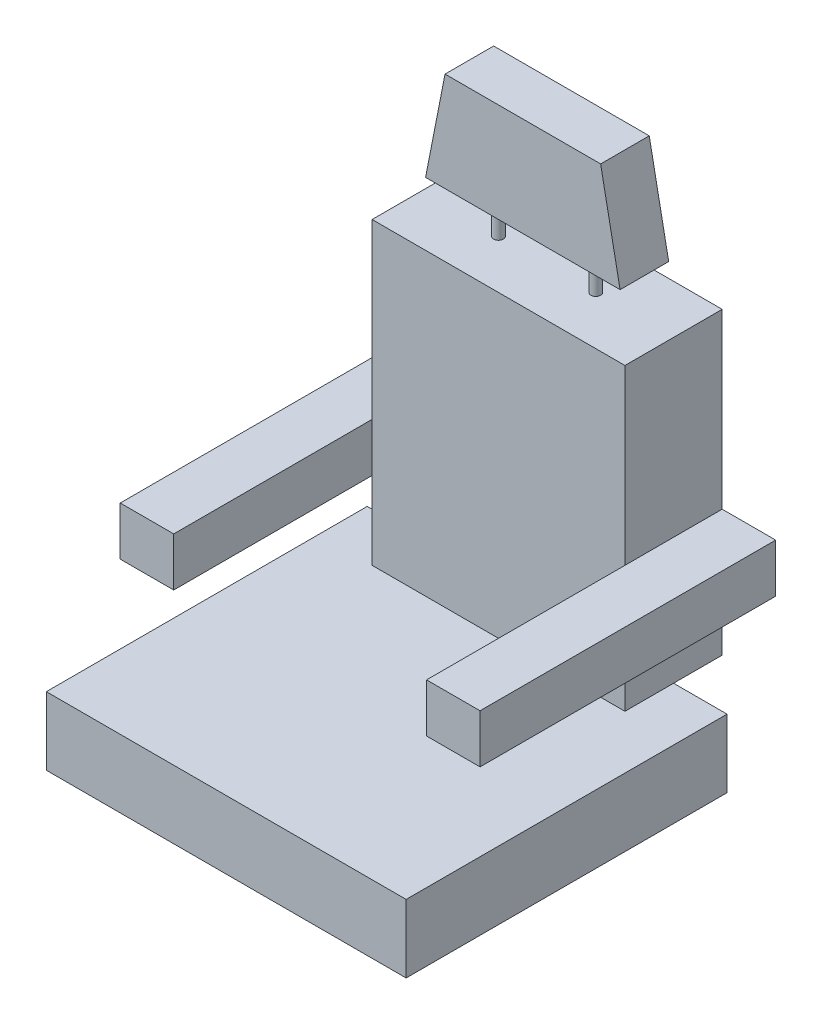
ISO-10303-21;
HEADER;
FILE_DESCRIPTION(('STEP AP214'),'2;1');
FILE_NAME('part.step','',(''),(''),'','','');
FILE_SCHEMA(('AUTOMOTIVE_DESIGN { 1 0 10303 214 1 1 1 1 }'));
ENDSEC;
DATA;
#1=APPLICATION_CONTEXT('core data for automotive mechanical design processes');
#2=APPLICATION_PROTOCOL_DEFINITION('international standard','automotive_design',2000,#1);
#3=PRODUCT_CONTEXT('',#1,'mechanical');
#4=PRODUCT('Part','Part','',(#3));
#5=PRODUCT_RELATED_PRODUCT_CATEGORY('part','',(#4));
#6=PRODUCT_DEFINITION_FORMATION('','',#4);
#7=PRODUCT_DEFINITION_CONTEXT('part definition',#1,'design');
#8=PRODUCT_DEFINITION('design','',#6,#7);
#9=PRODUCT_DEFINITION_SHAPE('','',#8);
#10=(LENGTH_UNIT() NAMED_UNIT(*) SI_UNIT(.MILLI.,.METRE.));
#11=(NAMED_UNIT(*) PLANE_ANGLE_UNIT() SI_UNIT($,.RADIAN.));
#12=(NAMED_UNIT(*) SI_UNIT($,.STERADIAN.) SOLID_ANGLE_UNIT());
#13=UNCERTAINTY_MEASURE_WITH_UNIT(LENGTH_MEASURE(1.E-05),#10,'distance_accuracy_value','');
#14=(GEOMETRIC_REPRESENTATION_CONTEXT(3) GLOBAL_UNCERTAINTY_ASSIGNED_CONTEXT((#13)) GLOBAL_UNIT_ASSIGNED_CONTEXT((#10,
#11,#12)) REPRESENTATION_CONTEXT('',''));
#15=CARTESIAN_POINT('',(0.,0.,0.));
#16=DIRECTION('',(0.,0.,1.));
#17=DIRECTION('',(1.,0.,0.));
#18=AXIS2_PLACEMENT_3D('',#15,#16,#17);
#19=CARTESIAN_POINT('',(-127.,660.4,-241.3));
#20=DIRECTION('',(0.,0.,1.));
#21=DIRECTION('',(1.,0.,0.));
#22=AXIS2_PLACEMENT_3D('',#19,#20,#21);
#23=PLANE('',#22);
#24=DIRECTION('',(-0.192414460721011,0.981313749677157,0.));
#25=VECTOR('',#24,1.);
#26=CARTESIAN_POINT('',(93.1364679748241,703.564013328397,-241.3));
#27=LINE('',#26,#25);
#28=CARTESIAN_POINT('',(127.,530.86,-241.3));
#29=VERTEX_POINT('',#28);
#30=CARTESIAN_POINT('',(101.6,660.4,-241.3));
#31=VERTEX_POINT('',#30);
#32=EDGE_CURVE('E184',#29,#31,#27,.T.);
#33=ORIENTED_EDGE('',*,*,#32,.F.);
#34=DIRECTION('',(-1.,0.,0.));
#35=VECTOR('',#34,1.);
#36=CARTESIAN_POINT('',(-127.,530.86,-241.3));
#37=LINE('',#36,#35);
#38=CARTESIAN_POINT('',(-127.,530.86,-241.3));
#39=VERTEX_POINT('',#38);
#40=EDGE_CURVE('E214',#29,#39,#37,.T.);
#41=ORIENTED_EDGE('',*,*,#40,.T.);
#42=DIRECTION('',(0.192414460721011,0.981313749677157,0.));
#43=VECTOR('',#42,1.);
#44=CARTESIAN_POINT('',(-102.540392447242,655.603998519067,-241.3));
#45=LINE('',#44,#43);
#46=CARTESIAN_POINT('',(-101.6,660.4,-241.3));
#47=VERTEX_POINT('',#46);
#48=EDGE_CURVE('E189',#39,#47,#45,.T.);
#49=ORIENTED_EDGE('',*,*,#48,.T.);
#50=DIRECTION('',(-1.,0.,0.));
#51=VECTOR('',#50,1.);
#52=CARTESIAN_POINT('',(-127.,660.4,-241.3));
#53=LINE('',#52,#51);
#54=EDGE_CURVE('E204',#31,#47,#53,.T.);
#55=ORIENTED_EDGE('',*,*,#54,.F.);
#56=EDGE_LOOP('',(#33,#41,#49,#55));
#57=FACE_BOUND('',#56,.T.);
#58=ADVANCED_FACE('F53',(#57),#23,.F.);
#59=CARTESIAN_POINT('',(-127.,660.4,-177.8));
#60=DIRECTION('',(0.,0.,-1.));
#61=DIRECTION('',(-1.,0.,0.));
#62=AXIS2_PLACEMENT_3D('',#59,#60,#61);
#63=PLANE('',#62);
#64=DIRECTION('',(-0.192414460721011,0.981313749677157,0.));
#65=VECTOR('',#64,1.);
#66=CARTESIAN_POINT('',(222.534468715291,43.6342095520177,-177.8));
#67=LINE('',#66,#65);
#68=CARTESIAN_POINT('',(127.,530.86,-177.8));
#69=VERTEX_POINT('',#68);
#70=CARTESIAN_POINT('',(101.6,660.4,-177.8));
#71=VERTEX_POINT('',#70);
#72=EDGE_CURVE('E181',#69,#71,#67,.T.);
#73=ORIENTED_EDGE('',*,*,#72,.T.);
#74=DIRECTION('',(1.,0.,0.));
#75=VECTOR('',#74,1.);
#76=CARTESIAN_POINT('',(-127.,660.4,-177.8));
#77=LINE('',#76,#75);
#78=CARTESIAN_POINT('',(-101.6,660.4,-177.8));
#79=VERTEX_POINT('',#78);
#80=EDGE_CURVE('E195',#79,#71,#77,.T.);
#81=ORIENTED_EDGE('',*,*,#80,.F.);
#82=DIRECTION('',(0.192414460721011,0.981313749677157,0.));
#83=VECTOR('',#82,1.);
#84=CARTESIAN_POINT('',(-222.534468715291,43.6342095520177,-177.8));
#85=LINE('',#84,#83);
#86=CARTESIAN_POINT('',(-127.,530.86,-177.8));
#87=VERTEX_POINT('',#86);
#88=EDGE_CURVE('E486',#87,#79,#85,.T.);
#89=ORIENTED_EDGE('',*,*,#88,.F.);
#90=DIRECTION('',(1.,0.,0.));
#91=VECTOR('',#90,1.);
#92=CARTESIAN_POINT('',(-127.,530.86,-177.8));
#93=LINE('',#92,#91);
#94=EDGE_CURVE('E197',#87,#69,#93,.T.);
#95=ORIENTED_EDGE('',*,*,#94,.T.);
#96=EDGE_LOOP('',(#73,#81,#89,#95));
#97=FACE_BOUND('',#96,.T.);
#98=ADVANCED_FACE('F193',(#97),#63,.F.);
#99=CARTESIAN_POINT('',(0.,660.4,0.));
#100=DIRECTION('',(0.,-1.,0.));
#101=DIRECTION('',(0.,0.,-1.));
#102=AXIS2_PLACEMENT_3D('',#99,#100,#101);
#103=PLANE('',#102);
#104=DIRECTION('',(0.,0.,1.));
#105=VECTOR('',#104,1.);
#106=CARTESIAN_POINT('',(101.6,660.4,-307.34));
#107=LINE('',#106,#105);
#108=EDGE_CURVE('E178',#31,#71,#107,.T.);
#109=ORIENTED_EDGE('',*,*,#108,.F.);
#110=ORIENTED_EDGE('',*,*,#54,.T.);
#111=DIRECTION('',(0.,0.,1.));
#112=VECTOR('',#111,1.);
#113=CARTESIAN_POINT('',(-101.6,660.4,-307.34));
#114=LINE('',#113,#112);
#115=EDGE_CURVE('E199',#47,#79,#114,.T.);
#116=ORIENTED_EDGE('',*,*,#115,.T.);
#117=ORIENTED_EDGE('',*,*,#80,.T.);
#118=EDGE_LOOP('',(#109,#110,#116,#117));
#119=FACE_BOUND('',#118,.T.);
#120=ADVANCED_FACE('F202',(#119),#103,.F.);
#121=CARTESIAN_POINT('',(-165.1,88.9,-146.05));
#122=DIRECTION('',(1.,0.,0.));
#123=DIRECTION('',(0.,0.,-1.));
#124=AXIS2_PLACEMENT_3D('',#121,#122,#123);
#125=PLANE('',#124);
#126=DIRECTION('',(0.,-1.,0.));
#127=VECTOR('',#126,1.);
#128=CARTESIAN_POINT('',(-165.1,88.9,-273.05));
#129=LINE('',#128,#127);
#130=CARTESIAN_POINT('',(-165.1,480.06,-273.05));
#131=VERTEX_POINT('',#130);
#132=CARTESIAN_POINT('',(-165.1,254.,-273.05));
#133=VERTEX_POINT('',#132);
#134=EDGE_CURVE('E297',#131,#133,#129,.T.);
#135=ORIENTED_EDGE('',*,*,#134,.T.);
#136=DIRECTION('',(0.,0.,1.));
#137=VECTOR('',#136,1.);
#138=CARTESIAN_POINT('',(-165.1,254.,-273.05));
#139=LINE('',#138,#137);
#140=CARTESIAN_POINT('',(-165.1,254.,-146.05));
#141=VERTEX_POINT('',#140);
#142=EDGE_CURVE('E227',#133,#141,#139,.T.);
#143=ORIENTED_EDGE('',*,*,#142,.T.);
#144=DIRECTION('',(0.,-1.,0.));
#145=VECTOR('',#144,1.);
#146=CARTESIAN_POINT('',(-165.1,88.9,-146.05));
#147=LINE('',#146,#145);
#148=CARTESIAN_POINT('',(-165.1,480.06,-146.05));
#149=VERTEX_POINT('',#148);
#150=EDGE_CURVE('E283',#149,#141,#147,.T.);
#151=ORIENTED_EDGE('',*,*,#150,.F.);
#152=DIRECTION('',(0.,0.,-1.));
#153=VECTOR('',#152,1.);
#154=CARTESIAN_POINT('',(-165.1,480.06,-146.05));
#155=LINE('',#154,#153);
#156=EDGE_CURVE('E296',#149,#131,#155,.T.);
#157=ORIENTED_EDGE('',*,*,#156,.T.);
#158=EDGE_LOOP('',(#135,#143,#151,#157));
#159=FACE_BOUND('',#158,.T.);
#160=ADVANCED_FACE('F360',(#159),#125,.F.);
#161=CARTESIAN_POINT('',(165.1,88.9,-146.05));
#162=DIRECTION('',(-1.,0.,0.));
#163=DIRECTION('',(0.,0.,1.));
#164=AXIS2_PLACEMENT_3D('',#161,#162,#163);
#165=PLANE('',#164);
#166=DIRECTION('',(0.,0.,-1.));
#167=VECTOR('',#166,1.);
#168=CARTESIAN_POINT('',(165.1,190.5,-273.05));
#169=LINE('',#168,#167);
#170=CARTESIAN_POINT('',(165.1,190.5,-146.05));
#171=VERTEX_POINT('',#170);
#172=CARTESIAN_POINT('',(165.1,190.5,-273.05));
#173=VERTEX_POINT('',#172);
#174=EDGE_CURVE('E76',#171,#173,#169,.T.);
#175=ORIENTED_EDGE('',*,*,#174,.F.);
#176=DIRECTION('',(0.,1.,0.));
#177=VECTOR('',#176,1.);
#178=CARTESIAN_POINT('',(165.1,88.9,-146.05));
#179=LINE('',#178,#177);
#180=CARTESIAN_POINT('',(165.1,88.9,-146.05));
#181=VERTEX_POINT('',#180);
#182=EDGE_CURVE('E291',#181,#171,#179,.T.);
#183=ORIENTED_EDGE('',*,*,#182,.F.);
#184=DIRECTION('',(0.,0.,-1.));
#185=VECTOR('',#184,1.);
#186=CARTESIAN_POINT('',(165.1,88.9,-146.05));
#187=LINE('',#186,#185);
#188=CARTESIAN_POINT('',(165.1,88.9,-273.05));
#189=VERTEX_POINT('',#188);
#190=EDGE_CURVE('E312',#181,#189,#187,.T.);
#191=ORIENTED_EDGE('',*,*,#190,.T.);
#192=DIRECTION('',(0.,1.,0.));
#193=VECTOR('',#192,1.);
#194=CARTESIAN_POINT('',(165.1,88.9,-273.05));
#195=LINE('',#194,#193);
#196=EDGE_CURVE('E303',#189,#173,#195,.T.);
#197=ORIENTED_EDGE('',*,*,#196,.T.);
#198=EDGE_LOOP('',(#175,#183,#191,#197));
#199=FACE_BOUND('',#198,.T.);
#200=ADVANCED_FACE('F496',(#199),#165,.F.);
#201=DIRECTION('',(0.,0.,1.));
#202=VECTOR('',#201,1.);
#203=CARTESIAN_POINT('',(165.1,254.,-273.05));
#204=LINE('',#203,#202);
#205=CARTESIAN_POINT('',(165.1,254.,-273.05));
#206=VERTEX_POINT('',#205);
#207=CARTESIAN_POINT('',(165.1,254.,-146.05));
#208=VERTEX_POINT('',#207);
#209=EDGE_CURVE('E264',#206,#208,#204,.T.);
#210=ORIENTED_EDGE('',*,*,#209,.F.);
#211=CARTESIAN_POINT('',(165.1,480.06,-273.05));
#212=VERTEX_POINT('',#211);
#213=EDGE_CURVE('E302',#206,#212,#195,.T.);
#214=ORIENTED_EDGE('',*,*,#213,.T.);
#215=DIRECTION('',(0.,0.,-1.));
#216=VECTOR('',#215,1.);
#217=CARTESIAN_POINT('',(165.1,480.06,-146.05));
#218=LINE('',#217,#216);
#219=CARTESIAN_POINT('',(165.1,480.06,-146.05));
#220=VERTEX_POINT('',#219);
#221=EDGE_CURVE('E309',#220,#212,#218,.T.);
#222=ORIENTED_EDGE('',*,*,#221,.F.);
#223=EDGE_CURVE('E290',#208,#220,#179,.T.);
#224=ORIENTED_EDGE('',*,*,#223,.F.);
#225=EDGE_LOOP('',(#210,#214,#222,#224));
#226=FACE_BOUND('',#225,.T.);
#227=ADVANCED_FACE('F354',(#226),#165,.F.);
#228=CARTESIAN_POINT('',(-165.1,190.5,-146.05));
#229=VERTEX_POINT('',#228);
#230=CARTESIAN_POINT('',(-165.1,88.9,-146.05));
#231=VERTEX_POINT('',#230);
#232=EDGE_CURVE('E288',#229,#231,#147,.T.);
#233=ORIENTED_EDGE('',*,*,#232,.F.);
#234=DIRECTION('',(0.,0.,-1.));
#235=VECTOR('',#234,1.);
#236=CARTESIAN_POINT('',(-165.1,190.5,-273.05));
#237=LINE('',#236,#235);
#238=CARTESIAN_POINT('',(-165.1,190.5,-273.05));
#239=VERTEX_POINT('',#238);
#240=EDGE_CURVE('E239',#229,#239,#237,.T.);
#241=ORIENTED_EDGE('',*,*,#240,.T.);
#242=CARTESIAN_POINT('',(-165.1,88.9,-273.05));
#243=VERTEX_POINT('',#242);
#244=EDGE_CURVE('E282',#239,#243,#129,.T.);
#245=ORIENTED_EDGE('',*,*,#244,.T.);
#246=DIRECTION('',(0.,0.,-1.));
#247=VECTOR('',#246,1.);
#248=CARTESIAN_POINT('',(-165.1,88.9,-146.05));
#249=LINE('',#248,#247);
#250=EDGE_CURVE('E315',#231,#243,#249,.T.);
#251=ORIENTED_EDGE('',*,*,#250,.F.);
#252=EDGE_LOOP('',(#233,#241,#245,#251));
#253=FACE_BOUND('',#252,.T.);
#254=ADVANCED_FACE('F55',(#253),#125,.F.);
#255=CARTESIAN_POINT('',(-165.1,88.9,-146.05));
#256=DIRECTION('',(0.,1.,0.));
#257=DIRECTION('',(0.,0.,1.));
#258=AXIS2_PLACEMENT_3D('',#255,#256,#257);
#259=PLANE('',#258);
#260=DIRECTION('',(1.,0.,0.));
#261=VECTOR('',#260,1.);
#262=CARTESIAN_POINT('',(-165.1,88.9,-273.05));
#263=LINE('',#262,#261);
#264=EDGE_CURVE('E300',#243,#189,#263,.T.);
#265=ORIENTED_EDGE('',*,*,#264,.T.);
#266=ORIENTED_EDGE('',*,*,#190,.F.);
#267=DIRECTION('',(1.,0.,0.));
#268=VECTOR('',#267,1.);
#269=CARTESIAN_POINT('',(-165.1,88.9,-146.05));
#270=LINE('',#269,#268);
#271=EDGE_CURVE('E286',#231,#181,#270,.T.);
#272=ORIENTED_EDGE('',*,*,#271,.F.);
#273=ORIENTED_EDGE('',*,*,#250,.T.);
#274=EDGE_LOOP('',(#265,#266,#272,#273));
#275=FACE_BOUND('',#274,.T.);
#276=ADVANCED_FACE('F425',(#275),#259,.F.);
#277=CARTESIAN_POINT('',(-165.1,480.06,-146.05));
#278=DIRECTION('',(0.,-1.,0.));
#279=DIRECTION('',(0.,0.,-1.));
#280=AXIS2_PLACEMENT_3D('',#277,#278,#279);
#281=PLANE('',#280);
#282=CARTESIAN_POINT('',(63.5,480.06,-209.55));
#283=DIRECTION('',(0.,-1.,0.));
#284=DIRECTION('',(0.,0.,-1.));
#285=AXIS2_PLACEMENT_3D('',#282,#283,#284);
#286=CIRCLE('',#285,6.34999999999999);
#287=CARTESIAN_POINT('',(63.5,480.06,-215.9));
#288=VERTEX_POINT('',#287);
#289=EDGE_CURVE('E12',#288,#288,#286,.F.);
#290=ORIENTED_EDGE('',*,*,#289,.F.);
#291=EDGE_LOOP('',(#290));
#292=FACE_BOUND('',#291,.T.);
#293=CARTESIAN_POINT('',(-63.5,480.06,-209.55));
#294=DIRECTION('',(0.,-1.,0.));
#295=DIRECTION('',(0.,0.,-1.));
#296=AXIS2_PLACEMENT_3D('',#293,#294,#295);
#297=CIRCLE('',#296,6.34999999999999);
#298=CARTESIAN_POINT('',(-63.5,480.06,-215.9));
#299=VERTEX_POINT('',#298);
#300=EDGE_CURVE('E61',#299,#299,#297,.F.);
#301=ORIENTED_EDGE('',*,*,#300,.F.);
#302=EDGE_LOOP('',(#301));
#303=FACE_BOUND('',#302,.T.);
#304=DIRECTION('',(-1.,0.,0.));
#305=VECTOR('',#304,1.);
#306=CARTESIAN_POINT('',(-165.1,480.06,-273.05));
#307=LINE('',#306,#305);
#308=EDGE_CURVE('E305',#212,#131,#307,.T.);
#309=ORIENTED_EDGE('',*,*,#308,.T.);
#310=ORIENTED_EDGE('',*,*,#156,.F.);
#311=DIRECTION('',(-1.,0.,0.));
#312=VECTOR('',#311,1.);
#313=CARTESIAN_POINT('',(-165.1,480.06,-146.05));
#314=LINE('',#313,#312);
#315=EDGE_CURVE('E293',#220,#149,#314,.T.);
#316=ORIENTED_EDGE('',*,*,#315,.F.);
#317=ORIENTED_EDGE('',*,*,#221,.T.);
#318=EDGE_LOOP('',(#309,#310,#316,#317));
#319=FACE_BOUND('',#318,.T.);
#320=ADVANCED_FACE('F357',(#292,#303,#319),#281,.F.);
#321=CARTESIAN_POINT('',(0.,0.,-146.05));
#322=DIRECTION('',(0.,0.,-1.));
#323=DIRECTION('',(-1.,0.,0.));
#324=AXIS2_PLACEMENT_3D('',#321,#322,#323);
#325=PLANE('',#324);
#326=ORIENTED_EDGE('',*,*,#150,.T.);
#327=EDGE_CURVE('E287',#141,#229,#147,.T.);
#328=ORIENTED_EDGE('',*,*,#327,.T.);
#329=ORIENTED_EDGE('',*,*,#232,.T.);
#330=ORIENTED_EDGE('',*,*,#271,.T.);
#331=ORIENTED_EDGE('',*,*,#182,.T.);
#332=EDGE_CURVE('E294',#171,#208,#179,.T.);
#333=ORIENTED_EDGE('',*,*,#332,.T.);
#334=ORIENTED_EDGE('',*,*,#223,.T.);
#335=ORIENTED_EDGE('',*,*,#315,.T.);
#336=EDGE_LOOP('',(#326,#328,#329,#330,#331,#333,#334,#335));
#337=FACE_BOUND('',#336,.T.);
#338=ADVANCED_FACE('F350',(#337),#325,.F.);
#339=CARTESIAN_POINT('',(0.,0.,-273.05));
#340=DIRECTION('',(0.,0.,-1.));
#341=DIRECTION('',(-1.,0.,0.));
#342=AXIS2_PLACEMENT_3D('',#339,#340,#341);
#343=PLANE('',#342);
#344=ORIENTED_EDGE('',*,*,#134,.F.);
#345=ORIENTED_EDGE('',*,*,#308,.F.);
#346=ORIENTED_EDGE('',*,*,#213,.F.);
#347=DIRECTION('',(-1.,0.,0.));
#348=VECTOR('',#347,1.);
#349=CARTESIAN_POINT('',(234.95,254.,-273.05));
#350=LINE('',#349,#348);
#351=CARTESIAN_POINT('',(234.95,254.,-273.05));
#352=VERTEX_POINT('',#351);
#353=EDGE_CURVE('E279',#352,#206,#350,.T.);
#354=ORIENTED_EDGE('',*,*,#353,.F.);
#355=DIRECTION('',(0.,1.,0.));
#356=VECTOR('',#355,1.);
#357=CARTESIAN_POINT('',(234.95,254.,-273.05));
#358=LINE('',#357,#356);
#359=CARTESIAN_POINT('',(234.95,190.5,-273.05));
#360=VERTEX_POINT('',#359);
#361=EDGE_CURVE('E253',#360,#352,#358,.T.);
#362=ORIENTED_EDGE('',*,*,#361,.F.);
#363=DIRECTION('',(-1.,0.,0.));
#364=VECTOR('',#363,1.);
#365=CARTESIAN_POINT('',(234.95,190.5,-273.05));
#366=LINE('',#365,#364);
#367=EDGE_CURVE('E263',#360,#173,#366,.T.);
#368=ORIENTED_EDGE('',*,*,#367,.T.);
#369=ORIENTED_EDGE('',*,*,#196,.F.);
#370=ORIENTED_EDGE('',*,*,#264,.F.);
#371=ORIENTED_EDGE('',*,*,#244,.F.);
#372=DIRECTION('',(1.,0.,0.));
#373=VECTOR('',#372,1.);
#374=CARTESIAN_POINT('',(-234.95,190.5,-273.05));
#375=LINE('',#374,#373);
#376=CARTESIAN_POINT('',(-234.95,190.5,-273.05));
#377=VERTEX_POINT('',#376);
#378=EDGE_CURVE('E68',#377,#239,#375,.T.);
#379=ORIENTED_EDGE('',*,*,#378,.F.);
#380=DIRECTION('',(0.,1.,0.));
#381=VECTOR('',#380,1.);
#382=CARTESIAN_POINT('',(-234.95,254.,-273.05));
#383=LINE('',#382,#381);
#384=CARTESIAN_POINT('',(-234.95,254.,-273.05));
#385=VERTEX_POINT('',#384);
#386=EDGE_CURVE('E223',#377,#385,#383,.T.);
#387=ORIENTED_EDGE('',*,*,#386,.T.);
#388=DIRECTION('',(1.,0.,0.));
#389=VECTOR('',#388,1.);
#390=CARTESIAN_POINT('',(-234.95,254.,-273.05));
#391=LINE('',#390,#389);
#392=EDGE_CURVE('E235',#385,#133,#391,.T.);
#393=ORIENTED_EDGE('',*,*,#392,.T.);
#394=EDGE_LOOP('',(#344,#345,#346,#354,#362,#368,#369,#370,#371,#379,#387,#393));
#395=FACE_BOUND('',#394,.T.);
#396=ADVANCED_FACE('F332',(#395),#343,.T.);
#397=CARTESIAN_POINT('',(165.1,0.,0.));
#398=DIRECTION('',(-1.,0.,0.));
#399=DIRECTION('',(0.,0.,1.));
#400=AXIS2_PLACEMENT_3D('',#397,#398,#399);
#401=PLANE('',#400);
#402=ORIENTED_EDGE('',*,*,#332,.F.);
#403=CARTESIAN_POINT('',(165.1,190.5,113.03));
#404=VERTEX_POINT('',#403);
#405=EDGE_CURVE('E257',#404,#171,#169,.T.);
#406=ORIENTED_EDGE('',*,*,#405,.F.);
#407=DIRECTION('',(0.,-1.,0.));
#408=VECTOR('',#407,1.);
#409=CARTESIAN_POINT('',(165.1,254.,113.03));
#410=LINE('',#409,#408);
#411=CARTESIAN_POINT('',(165.1,254.,113.03));
#412=VERTEX_POINT('',#411);
#413=EDGE_CURVE('E267',#412,#404,#410,.T.);
#414=ORIENTED_EDGE('',*,*,#413,.F.);
#415=EDGE_CURVE('E252',#208,#412,#204,.T.);
#416=ORIENTED_EDGE('',*,*,#415,.F.);
#417=EDGE_LOOP('',(#402,#406,#414,#416));
#418=FACE_BOUND('',#417,.T.);
#419=ADVANCED_FACE('F345',(#418),#401,.T.);
#420=CARTESIAN_POINT('',(234.95,254.,-273.05));
#421=DIRECTION('',(0.,-1.,0.));
#422=DIRECTION('',(0.,0.,-1.));
#423=AXIS2_PLACEMENT_3D('',#420,#421,#422);
#424=PLANE('',#423);
#425=ORIENTED_EDGE('',*,*,#209,.T.);
#426=ORIENTED_EDGE('',*,*,#415,.T.);
#427=DIRECTION('',(-1.,0.,0.));
#428=VECTOR('',#427,1.);
#429=CARTESIAN_POINT('',(234.95,254.,113.03));
#430=LINE('',#429,#428);
#431=CARTESIAN_POINT('',(234.95,254.,113.03));
#432=VERTEX_POINT('',#431);
#433=EDGE_CURVE('E276',#432,#412,#430,.T.);
#434=ORIENTED_EDGE('',*,*,#433,.F.);
#435=DIRECTION('',(0.,0.,1.));
#436=VECTOR('',#435,1.);
#437=CARTESIAN_POINT('',(234.95,254.,-273.05));
#438=LINE('',#437,#436);
#439=EDGE_CURVE('E256',#352,#432,#438,.T.);
#440=ORIENTED_EDGE('',*,*,#439,.F.);
#441=ORIENTED_EDGE('',*,*,#353,.T.);
#442=EDGE_LOOP('',(#425,#426,#434,#440,#441));
#443=FACE_BOUND('',#442,.T.);
#444=ADVANCED_FACE('F513',(#443),#424,.F.);
#445=CARTESIAN_POINT('',(234.95,254.,113.03));
#446=DIRECTION('',(0.,0.,-1.));
#447=DIRECTION('',(0.,1.,0.));
#448=AXIS2_PLACEMENT_3D('',#445,#446,#447);
#449=PLANE('',#448);
#450=ORIENTED_EDGE('',*,*,#413,.T.);
#451=DIRECTION('',(-1.,0.,0.));
#452=VECTOR('',#451,1.);
#453=CARTESIAN_POINT('',(234.95,190.5,113.03));
#454=LINE('',#453,#452);
#455=CARTESIAN_POINT('',(234.95,190.5,113.03));
#456=VERTEX_POINT('',#455);
#457=EDGE_CURVE('E273',#456,#404,#454,.T.);
#458=ORIENTED_EDGE('',*,*,#457,.F.);
#459=DIRECTION('',(0.,-1.,0.));
#460=VECTOR('',#459,1.);
#461=CARTESIAN_POINT('',(234.95,254.,113.03));
#462=LINE('',#461,#460);
#463=EDGE_CURVE('E259',#432,#456,#462,.T.);
#464=ORIENTED_EDGE('',*,*,#463,.F.);
#465=ORIENTED_EDGE('',*,*,#433,.T.);
#466=EDGE_LOOP('',(#450,#458,#464,#465));
#467=FACE_BOUND('',#466,.T.);
#468=ADVANCED_FACE('F514',(#467),#449,.F.);
#469=CARTESIAN_POINT('',(234.95,190.5,-273.05));
#470=DIRECTION('',(0.,1.,0.));
#471=DIRECTION('',(0.,0.,1.));
#472=AXIS2_PLACEMENT_3D('',#469,#470,#471);
#473=PLANE('',#472);
#474=ORIENTED_EDGE('',*,*,#405,.T.);
#475=ORIENTED_EDGE('',*,*,#174,.T.);
#476=ORIENTED_EDGE('',*,*,#367,.F.);
#477=DIRECTION('',(0.,0.,-1.));
#478=VECTOR('',#477,1.);
#479=CARTESIAN_POINT('',(234.95,190.5,-273.05));
#480=LINE('',#479,#478);
#481=EDGE_CURVE('E261',#456,#360,#480,.T.);
#482=ORIENTED_EDGE('',*,*,#481,.F.);
#483=ORIENTED_EDGE('',*,*,#457,.T.);
#484=EDGE_LOOP('',(#474,#475,#476,#482,#483));
#485=FACE_BOUND('',#484,.T.);
#486=ADVANCED_FACE('F325',(#485),#473,.F.);
#487=CARTESIAN_POINT('',(234.95,0.,0.));
#488=DIRECTION('',(-1.,0.,0.));
#489=DIRECTION('',(0.,0.,1.));
#490=AXIS2_PLACEMENT_3D('',#487,#488,#489);
#491=PLANE('',#490);
#492=ORIENTED_EDGE('',*,*,#361,.T.);
#493=ORIENTED_EDGE('',*,*,#439,.T.);
#494=ORIENTED_EDGE('',*,*,#463,.T.);
#495=ORIENTED_EDGE('',*,*,#481,.T.);
#496=EDGE_LOOP('',(#492,#493,#494,#495));
#497=FACE_BOUND('',#496,.T.);
#498=ADVANCED_FACE('F337',(#497),#491,.F.);
#499=CARTESIAN_POINT('',(-165.1,0.,0.));
#500=DIRECTION('',(1.,0.,0.));
#501=DIRECTION('',(0.,0.,1.));
#502=AXIS2_PLACEMENT_3D('',#499,#500,#501);
#503=PLANE('',#502);
#504=ORIENTED_EDGE('',*,*,#327,.F.);
#505=CARTESIAN_POINT('',(-165.1,254.,113.03));
#506=VERTEX_POINT('',#505);
#507=EDGE_CURVE('E242',#141,#506,#139,.T.);
#508=ORIENTED_EDGE('',*,*,#507,.T.);
#509=DIRECTION('',(0.,-1.,0.));
#510=VECTOR('',#509,1.);
#511=CARTESIAN_POINT('',(-165.1,254.,113.03));
#512=LINE('',#511,#510);
#513=CARTESIAN_POINT('',(-165.1,190.5,113.03));
#514=VERTEX_POINT('',#513);
#515=EDGE_CURVE('E238',#506,#514,#512,.T.);
#516=ORIENTED_EDGE('',*,*,#515,.T.);
#517=EDGE_CURVE('E222',#514,#229,#237,.T.);
#518=ORIENTED_EDGE('',*,*,#517,.T.);
#519=EDGE_LOOP('',(#504,#508,#516,#518));
#520=FACE_BOUND('',#519,.T.);
#521=ADVANCED_FACE('F366',(#520),#503,.T.);
#522=CARTESIAN_POINT('',(-234.95,190.5,-273.05));
#523=DIRECTION('',(0.,-1.,0.));
#524=DIRECTION('',(0.,0.,-1.));
#525=AXIS2_PLACEMENT_3D('',#522,#523,#524);
#526=PLANE('',#525);
#527=ORIENTED_EDGE('',*,*,#517,.F.);
#528=DIRECTION('',(1.,0.,0.));
#529=VECTOR('',#528,1.);
#530=CARTESIAN_POINT('',(-234.95,190.5,113.03));
#531=LINE('',#530,#529);
#532=CARTESIAN_POINT('',(-234.95,190.5,113.03));
#533=VERTEX_POINT('',#532);
#534=EDGE_CURVE('E249',#533,#514,#531,.T.);
#535=ORIENTED_EDGE('',*,*,#534,.F.);
#536=DIRECTION('',(0.,0.,-1.));
#537=VECTOR('',#536,1.);
#538=CARTESIAN_POINT('',(-234.95,190.5,-273.05));
#539=LINE('',#538,#537);
#540=EDGE_CURVE('E226',#533,#377,#539,.T.);
#541=ORIENTED_EDGE('',*,*,#540,.T.);
#542=ORIENTED_EDGE('',*,*,#378,.T.);
#543=ORIENTED_EDGE('',*,*,#240,.F.);
#544=EDGE_LOOP('',(#527,#535,#541,#542,#543));
#545=FACE_BOUND('',#544,.T.);
#546=ADVANCED_FACE('F376',(#545),#526,.T.);
#547=CARTESIAN_POINT('',(-234.95,254.,113.03));
#548=DIRECTION('',(0.,0.,1.));
#549=DIRECTION('',(0.,-1.,0.));
#550=AXIS2_PLACEMENT_3D('',#547,#548,#549);
#551=PLANE('',#550);
#552=ORIENTED_EDGE('',*,*,#515,.F.);
#553=DIRECTION('',(1.,0.,0.));
#554=VECTOR('',#553,1.);
#555=CARTESIAN_POINT('',(-234.95,254.,113.03));
#556=LINE('',#555,#554);
#557=CARTESIAN_POINT('',(-234.95,254.,113.03));
#558=VERTEX_POINT('',#557);
#559=EDGE_CURVE('E246',#558,#506,#556,.T.);
#560=ORIENTED_EDGE('',*,*,#559,.F.);
#561=DIRECTION('',(0.,-1.,0.));
#562=VECTOR('',#561,1.);
#563=CARTESIAN_POINT('',(-234.95,254.,113.03));
#564=LINE('',#563,#562);
#565=EDGE_CURVE('E229',#558,#533,#564,.T.);
#566=ORIENTED_EDGE('',*,*,#565,.T.);
#567=ORIENTED_EDGE('',*,*,#534,.T.);
#568=EDGE_LOOP('',(#552,#560,#566,#567));
#569=FACE_BOUND('',#568,.T.);
#570=ADVANCED_FACE('F374',(#569),#551,.T.);
#571=CARTESIAN_POINT('',(-234.95,254.,-273.05));
#572=DIRECTION('',(0.,1.,0.));
#573=DIRECTION('',(0.,0.,1.));
#574=AXIS2_PLACEMENT_3D('',#571,#572,#573);
#575=PLANE('',#574);
#576=ORIENTED_EDGE('',*,*,#142,.F.);
#577=ORIENTED_EDGE('',*,*,#392,.F.);
#578=DIRECTION('',(0.,0.,1.));
#579=VECTOR('',#578,1.);
#580=CARTESIAN_POINT('',(-234.95,254.,-273.05));
#581=LINE('',#580,#579);
#582=EDGE_CURVE('E232',#385,#558,#581,.T.);
#583=ORIENTED_EDGE('',*,*,#582,.T.);
#584=ORIENTED_EDGE('',*,*,#559,.T.);
#585=ORIENTED_EDGE('',*,*,#507,.F.);
#586=EDGE_LOOP('',(#576,#577,#583,#584,#585));
#587=FACE_BOUND('',#586,.T.);
#588=ADVANCED_FACE('F369',(#587),#575,.T.);
#589=CARTESIAN_POINT('',(-234.95,0.,0.));
#590=DIRECTION('',(1.,0.,0.));
#591=DIRECTION('',(0.,0.,1.));
#592=AXIS2_PLACEMENT_3D('',#589,#590,#591);
#593=PLANE('',#592);
#594=ORIENTED_EDGE('',*,*,#386,.F.);
#595=ORIENTED_EDGE('',*,*,#540,.F.);
#596=ORIENTED_EDGE('',*,*,#565,.F.);
#597=ORIENTED_EDGE('',*,*,#582,.F.);
#598=EDGE_LOOP('',(#594,#595,#596,#597));
#599=FACE_BOUND('',#598,.T.);
#600=ADVANCED_FACE('F403',(#599),#593,.F.);
#601=CARTESIAN_POINT('',(-63.5,530.86,-209.55));
#602=DIRECTION('',(0.,-1.,0.));
#603=DIRECTION('',(0.,0.,-1.));
#604=AXIS2_PLACEMENT_3D('',#601,#602,#603);
#605=CYLINDRICAL_SURFACE('',#604,6.34999999999999);
#606=CARTESIAN_POINT('',(-63.5,530.86,-209.55));
#607=DIRECTION('',(0.,1.,0.));
#608=DIRECTION('',(0.,0.,1.));
#609=AXIS2_PLACEMENT_3D('',#606,#607,#608);
#610=CIRCLE('',#609,6.34999999999999);
#611=CARTESIAN_POINT('',(-63.5,530.86,-203.2));
#612=VERTEX_POINT('',#611);
#613=EDGE_CURVE('E207',#612,#612,#610,.T.);
#614=ORIENTED_EDGE('',*,*,#613,.F.);
#615=EDGE_LOOP('',(#614));
#616=FACE_BOUND('',#615,.T.);
#617=ORIENTED_EDGE('',*,*,#300,.T.);
#618=EDGE_LOOP('',(#617));
#619=FACE_BOUND('',#618,.T.);
#620=ADVANCED_FACE('F399',(#616,#619),#605,.T.);
#621=CARTESIAN_POINT('',(63.5,530.86,-209.55));
#622=DIRECTION('',(0.,-1.,0.));
#623=DIRECTION('',(0.,0.,-1.));
#624=AXIS2_PLACEMENT_3D('',#621,#622,#623);
#625=CYLINDRICAL_SURFACE('',#624,6.34999999999999);
#626=CARTESIAN_POINT('',(63.5,530.86,-209.55));
#627=DIRECTION('',(0.,1.,0.));
#628=DIRECTION('',(0.,0.,-1.));
#629=AXIS2_PLACEMENT_3D('',#626,#627,#628);
#630=CIRCLE('',#629,6.34999999999999);
#631=CARTESIAN_POINT('',(63.5,530.86,-215.9));
#632=VERTEX_POINT('',#631);
#633=EDGE_CURVE('E203',#632,#632,#630,.T.);
#634=ORIENTED_EDGE('',*,*,#633,.F.);
#635=EDGE_LOOP('',(#634));
#636=FACE_BOUND('',#635,.T.);
#637=ORIENTED_EDGE('',*,*,#289,.T.);
#638=EDGE_LOOP('',(#637));
#639=FACE_BOUND('',#638,.T.);
#640=ADVANCED_FACE('F396',(#636,#639),#625,.T.);
#641=CARTESIAN_POINT('',(0.,530.86,0.));
#642=DIRECTION('',(0.,-1.,0.));
#643=DIRECTION('',(0.,0.,-1.));
#644=AXIS2_PLACEMENT_3D('',#641,#642,#643);
#645=PLANE('',#644);
#646=ORIENTED_EDGE('',*,*,#613,.T.);
#647=EDGE_LOOP('',(#646));
#648=FACE_BOUND('',#647,.T.);
#649=ORIENTED_EDGE('',*,*,#633,.T.);
#650=EDGE_LOOP('',(#649));
#651=FACE_BOUND('',#650,.T.);
#652=DIRECTION('',(0.,0.,-1.));
#653=VECTOR('',#652,1.);
#654=CARTESIAN_POINT('',(127.,530.86,-177.8));
#655=LINE('',#654,#653);
#656=EDGE_CURVE('E212',#69,#29,#655,.T.);
#657=ORIENTED_EDGE('',*,*,#656,.F.);
#658=ORIENTED_EDGE('',*,*,#94,.F.);
#659=DIRECTION('',(0.,0.,1.));
#660=VECTOR('',#659,1.);
#661=CARTESIAN_POINT('',(-127.,530.86,-177.8));
#662=LINE('',#661,#660);
#663=EDGE_CURVE('E217',#39,#87,#662,.T.);
#664=ORIENTED_EDGE('',*,*,#663,.F.);
#665=ORIENTED_EDGE('',*,*,#40,.F.);
#666=EDGE_LOOP('',(#657,#658,#664,#665));
#667=FACE_BOUND('',#666,.T.);
#668=ADVANCED_FACE('F398',(#648,#651,#667),#645,.T.);
#669=CARTESIAN_POINT('',(-222.534468715291,43.6342095520177,-307.34));
#670=DIRECTION('',(0.981313749677157,-0.192414460721011,0.));
#671=DIRECTION('',(0.192414460721011,0.981313749677157,0.));
#672=AXIS2_PLACEMENT_3D('',#669,#670,#671);
#673=PLANE('',#672);
#674=ORIENTED_EDGE('',*,*,#663,.T.);
#675=ORIENTED_EDGE('',*,*,#88,.T.);
#676=ORIENTED_EDGE('',*,*,#115,.F.);
#677=ORIENTED_EDGE('',*,*,#48,.F.);
#678=EDGE_LOOP('',(#674,#675,#676,#677));
#679=FACE_BOUND('',#678,.T.);
#680=ADVANCED_FACE('F449',(#679),#673,.F.);
#681=CARTESIAN_POINT('',(222.534468715291,43.6342095520177,-307.34));
#682=DIRECTION('',(0.981313749677157,0.192414460721011,0.));
#683=DIRECTION('',(-0.192414460721011,0.981313749677157,0.));
#684=AXIS2_PLACEMENT_3D('',#681,#682,#683);
#685=PLANE('',#684);
#686=ORIENTED_EDGE('',*,*,#32,.T.);
#687=ORIENTED_EDGE('',*,*,#108,.T.);
#688=ORIENTED_EDGE('',*,*,#72,.F.);
#689=ORIENTED_EDGE('',*,*,#656,.T.);
#690=EDGE_LOOP('',(#686,#687,#688,#689));
#691=FACE_BOUND('',#690,.T.);
#692=ADVANCED_FACE('F180',(#691),#685,.T.);
#693=CLOSED_SHELL('',(#58,#98,#120,#160,#200,#227,#254,#276,#320,#338,#396,#419,#444,#468,#486,
#498,#521,#546,#570,#588,#600,#620,#640,#668,#680,#692));
#694=MANIFOLD_SOLID_BREP('B2',#693);
#695=CARTESIAN_POINT('',(234.95,88.9,-209.55));
#696=DIRECTION('',(-1.,0.,0.));
#697=DIRECTION('',(0.,0.,1.));
#698=AXIS2_PLACEMENT_3D('',#695,#696,#697);
#699=PLANE('',#698);
#700=DIRECTION('',(0.,0.,-1.));
#701=VECTOR('',#700,1.);
#702=CARTESIAN_POINT('',(234.95,0.,-209.55));
#703=LINE('',#702,#701);
#704=CARTESIAN_POINT('',(234.95,0.,209.55));
#705=VERTEX_POINT('',#704);
#706=CARTESIAN_POINT('',(234.95,0.,-209.55));
#707=VERTEX_POINT('',#706);
#708=EDGE_CURVE('E688',#705,#707,#703,.T.);
#709=ORIENTED_EDGE('',*,*,#708,.T.);
#710=DIRECTION('',(0.,-1.,0.));
#711=VECTOR('',#710,1.);
#712=CARTESIAN_POINT('',(234.95,88.9,-209.55));
#713=LINE('',#712,#711);
#714=CARTESIAN_POINT('',(234.95,88.9,-209.55));
#715=VERTEX_POINT('',#714);
#716=EDGE_CURVE('E51',#715,#707,#713,.T.);
#717=ORIENTED_EDGE('',*,*,#716,.F.);
#718=DIRECTION('',(0.,0.,-1.));
#719=VECTOR('',#718,1.);
#720=CARTESIAN_POINT('',(234.95,88.9,-209.55));
#721=LINE('',#720,#719);
#722=CARTESIAN_POINT('',(234.95,88.9,209.55));
#723=VERTEX_POINT('',#722);
#724=EDGE_CURVE('E676',#723,#715,#721,.T.);
#725=ORIENTED_EDGE('',*,*,#724,.F.);
#726=DIRECTION('',(0.,-1.,0.));
#727=VECTOR('',#726,1.);
#728=CARTESIAN_POINT('',(234.95,88.9,209.55));
#729=LINE('',#728,#727);
#730=EDGE_CURVE('E684',#723,#705,#729,.T.);
#731=ORIENTED_EDGE('',*,*,#730,.T.);
#732=EDGE_LOOP('',(#709,#717,#725,#731));
#733=FACE_BOUND('',#732,.T.);
#734=ADVANCED_FACE('F625',(#733),#699,.F.);
#735=CARTESIAN_POINT('',(-234.95,88.9,-209.55));
#736=DIRECTION('',(0.,0.,1.));
#737=DIRECTION('',(1.,0.,0.));
#738=AXIS2_PLACEMENT_3D('',#735,#736,#737);
#739=PLANE('',#738);
#740=DIRECTION('',(-1.,0.,0.));
#741=VECTOR('',#740,1.);
#742=CARTESIAN_POINT('',(-234.95,0.,-209.55));
#743=LINE('',#742,#741);
#744=CARTESIAN_POINT('',(-234.95,0.,-209.55));
#745=VERTEX_POINT('',#744);
#746=EDGE_CURVE('E680',#707,#745,#743,.T.);
#747=ORIENTED_EDGE('',*,*,#746,.T.);
#748=DIRECTION('',(0.,-1.,0.));
#749=VECTOR('',#748,1.);
#750=CARTESIAN_POINT('',(-234.95,88.9,-209.55));
#751=LINE('',#750,#749);
#752=CARTESIAN_POINT('',(-234.95,88.9,-209.55));
#753=VERTEX_POINT('',#752);
#754=EDGE_CURVE('E633',#753,#745,#751,.T.);
#755=ORIENTED_EDGE('',*,*,#754,.F.);
#756=DIRECTION('',(-1.,0.,0.));
#757=VECTOR('',#756,1.);
#758=CARTESIAN_POINT('',(-234.95,88.9,-209.55));
#759=LINE('',#758,#757);
#760=EDGE_CURVE('E671',#715,#753,#759,.T.);
#761=ORIENTED_EDGE('',*,*,#760,.F.);
#762=ORIENTED_EDGE('',*,*,#716,.T.);
#763=EDGE_LOOP('',(#747,#755,#761,#762));
#764=FACE_BOUND('',#763,.T.);
#765=ADVANCED_FACE('F679',(#764),#739,.F.);
#766=CARTESIAN_POINT('',(-234.95,88.9,-209.55));
#767=DIRECTION('',(1.,0.,0.));
#768=DIRECTION('',(0.,0.,-1.));
#769=AXIS2_PLACEMENT_3D('',#766,#767,#768);
#770=PLANE('',#769);
#771=DIRECTION('',(0.,0.,1.));
#772=VECTOR('',#771,1.);
#773=CARTESIAN_POINT('',(-234.95,0.,-209.55));
#774=LINE('',#773,#772);
#775=CARTESIAN_POINT('',(-234.95,0.,209.55));
#776=VERTEX_POINT('',#775);
#777=EDGE_CURVE('E658',#745,#776,#774,.T.);
#778=ORIENTED_EDGE('',*,*,#777,.T.);
#779=DIRECTION('',(0.,-1.,0.));
#780=VECTOR('',#779,1.);
#781=CARTESIAN_POINT('',(-234.95,88.9,209.55));
#782=LINE('',#781,#780);
#783=CARTESIAN_POINT('',(-234.95,88.9,209.55));
#784=VERTEX_POINT('',#783);
#785=EDGE_CURVE('E681',#784,#776,#782,.T.);
#786=ORIENTED_EDGE('',*,*,#785,.F.);
#787=DIRECTION('',(0.,0.,1.));
#788=VECTOR('',#787,1.);
#789=CARTESIAN_POINT('',(-234.95,88.9,-209.55));
#790=LINE('',#789,#788);
#791=EDGE_CURVE('E674',#753,#784,#790,.T.);
#792=ORIENTED_EDGE('',*,*,#791,.F.);
#793=ORIENTED_EDGE('',*,*,#754,.T.);
#794=EDGE_LOOP('',(#778,#786,#792,#793));
#795=FACE_BOUND('',#794,.T.);
#796=ADVANCED_FACE('F682',(#795),#770,.F.);
#797=CARTESIAN_POINT('',(-234.95,88.9,209.55));
#798=DIRECTION('',(0.,0.,-1.));
#799=DIRECTION('',(-1.,0.,0.));
#800=AXIS2_PLACEMENT_3D('',#797,#798,#799);
#801=PLANE('',#800);
#802=DIRECTION('',(1.,0.,0.));
#803=VECTOR('',#802,1.);
#804=CARTESIAN_POINT('',(-234.95,0.,209.55));
#805=LINE('',#804,#803);
#806=EDGE_CURVE('E664',#776,#705,#805,.T.);
#807=ORIENTED_EDGE('',*,*,#806,.T.);
#808=ORIENTED_EDGE('',*,*,#730,.F.);
#809=DIRECTION('',(1.,0.,0.));
#810=VECTOR('',#809,1.);
#811=CARTESIAN_POINT('',(-234.95,88.9,209.55));
#812=LINE('',#811,#810);
#813=EDGE_CURVE('E641',#784,#723,#812,.T.);
#814=ORIENTED_EDGE('',*,*,#813,.F.);
#815=ORIENTED_EDGE('',*,*,#785,.T.);
#816=EDGE_LOOP('',(#807,#808,#814,#815));
#817=FACE_BOUND('',#816,.T.);
#818=ADVANCED_FACE('F695',(#817),#801,.F.);
#819=CARTESIAN_POINT('',(0.,88.9,0.));
#820=DIRECTION('',(0.,1.,0.));
#821=DIRECTION('',(0.,0.,1.));
#822=AXIS2_PLACEMENT_3D('',#819,#820,#821);
#823=PLANE('',#822);
#824=ORIENTED_EDGE('',*,*,#724,.T.);
#825=ORIENTED_EDGE('',*,*,#760,.T.);
#826=ORIENTED_EDGE('',*,*,#791,.T.);
#827=ORIENTED_EDGE('',*,*,#813,.T.);
#828=EDGE_LOOP('',(#824,#825,#826,#827));
#829=FACE_BOUND('',#828,.T.);
#830=ADVANCED_FACE('F672',(#829),#823,.T.);
#831=CARTESIAN_POINT('',(0.,0.,0.));
#832=DIRECTION('',(0.,1.,0.));
#833=DIRECTION('',(0.,0.,1.));
#834=AXIS2_PLACEMENT_3D('',#831,#832,#833);
#835=PLANE('',#834);
#836=ORIENTED_EDGE('',*,*,#708,.F.);
#837=ORIENTED_EDGE('',*,*,#806,.F.);
#838=ORIENTED_EDGE('',*,*,#777,.F.);
#839=ORIENTED_EDGE('',*,*,#746,.F.);
#840=EDGE_LOOP('',(#836,#837,#838,#839));
#841=FACE_BOUND('',#840,.T.);
#842=ADVANCED_FACE('F698',(#841),#835,.F.);
#843=CLOSED_SHELL('',(#734,#765,#796,#818,#830,#842));
#844=MANIFOLD_SOLID_BREP('B6',#843);
#845=ADVANCED_BREP_SHAPE_REPRESENTATION('',(#18,#694,#844),#14);
#846=SHAPE_DEFINITION_REPRESENTATION(#9,#845);
ENDSEC;
END-ISO-10303-21;
